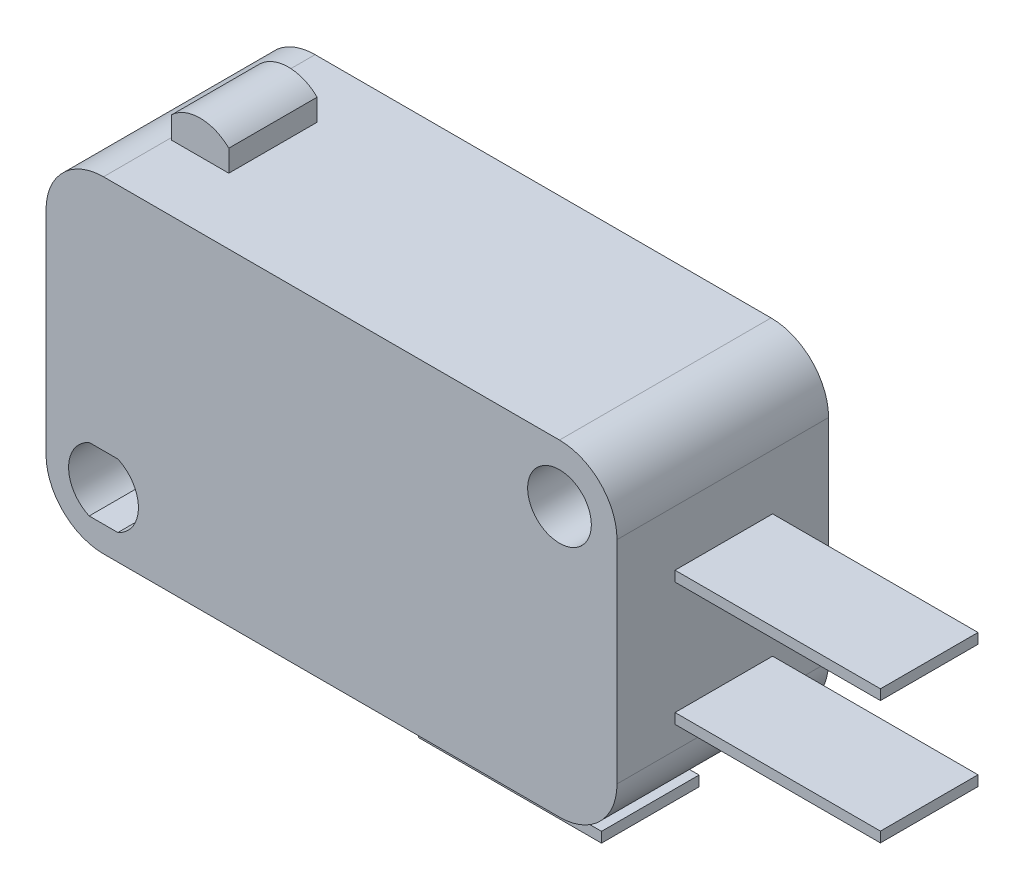
ISO-10303-21;
HEADER;
FILE_DESCRIPTION(('STEP AP214'),'2;1');
FILE_NAME('part.step','',(''),(''),'','','');
FILE_SCHEMA(('AUTOMOTIVE_DESIGN { 1 0 10303 214 1 1 1 1 }'));
ENDSEC;
DATA;
#1=APPLICATION_CONTEXT('core data for automotive mechanical design processes');
#2=APPLICATION_PROTOCOL_DEFINITION('international standard','automotive_design',2000,#1);
#3=PRODUCT_CONTEXT('',#1,'mechanical');
#4=PRODUCT('Part','Part','',(#3));
#5=PRODUCT_RELATED_PRODUCT_CATEGORY('part','',(#4));
#6=PRODUCT_DEFINITION_FORMATION('','',#4);
#7=PRODUCT_DEFINITION_CONTEXT('part definition',#1,'design');
#8=PRODUCT_DEFINITION('design','',#6,#7);
#9=PRODUCT_DEFINITION_SHAPE('','',#8);
#10=(LENGTH_UNIT() NAMED_UNIT(*) SI_UNIT(.MILLI.,.METRE.));
#11=(NAMED_UNIT(*) PLANE_ANGLE_UNIT() SI_UNIT($,.RADIAN.));
#12=(NAMED_UNIT(*) SI_UNIT($,.STERADIAN.) SOLID_ANGLE_UNIT());
#13=UNCERTAINTY_MEASURE_WITH_UNIT(LENGTH_MEASURE(1.E-05),#10,'distance_accuracy_value','');
#14=(GEOMETRIC_REPRESENTATION_CONTEXT(3) GLOBAL_UNCERTAINTY_ASSIGNED_CONTEXT((#13)) GLOBAL_UNIT_ASSIGNED_CONTEXT((#10,
#11,#12)) REPRESENTATION_CONTEXT('',''));
#15=CARTESIAN_POINT('',(0.,0.,0.));
#16=DIRECTION('',(0.,0.,1.));
#17=DIRECTION('',(1.,0.,0.));
#18=AXIS2_PLACEMENT_3D('',#15,#16,#17);
#19=CARTESIAN_POINT('',(-25.,-13.1,5.15));
#20=DIRECTION('',(0.,1.,0.));
#21=DIRECTION('',(-1.,0.,0.));
#22=AXIS2_PLACEMENT_3D('',#19,#20,#21);
#23=PLANE('',#22);
#24=DIRECTION('',(1.,0.,0.));
#25=VECTOR('',#24,1.);
#26=CARTESIAN_POINT('',(-25.,-13.1,5.15));
#27=LINE('',#26,#25);
#28=CARTESIAN_POINT('',(-22.2,-13.1,5.15));
#29=VERTEX_POINT('',#28);
#30=CARTESIAN_POINT('',(0.,-13.1,5.15));
#31=VERTEX_POINT('',#30);
#32=EDGE_CURVE('E410',#29,#31,#27,.T.);
#33=ORIENTED_EDGE('',*,*,#32,.F.);
#34=DIRECTION('',(0.,0.,-1.));
#35=VECTOR('',#34,1.);
#36=CARTESIAN_POINT('',(-22.2,-13.1,5.15));
#37=LINE('',#36,#35);
#38=CARTESIAN_POINT('',(-22.2,-13.1,-5.15));
#39=VERTEX_POINT('',#38);
#40=EDGE_CURVE('E447',#29,#39,#37,.T.);
#41=ORIENTED_EDGE('',*,*,#40,.T.);
#42=DIRECTION('',(1.,0.,0.));
#43=VECTOR('',#42,1.);
#44=CARTESIAN_POINT('',(-25.,-13.1,-5.15));
#45=LINE('',#44,#43);
#46=CARTESIAN_POINT('',(0.,-13.1,-5.15));
#47=VERTEX_POINT('',#46);
#48=EDGE_CURVE('E398',#39,#47,#45,.T.);
#49=ORIENTED_EDGE('',*,*,#48,.T.);
#50=DIRECTION('',(0.,0.,-1.));
#51=VECTOR('',#50,1.);
#52=CARTESIAN_POINT('',(0.,-13.1,5.15));
#53=LINE('',#52,#51);
#54=EDGE_CURVE('E445',#47,#31,#53,.F.);
#55=ORIENTED_EDGE('',*,*,#54,.T.);
#56=EDGE_LOOP('',(#33,#41,#49,#55));
#57=FACE_BOUND('',#56,.T.);
#58=DIRECTION('',(-1.,0.,0.));
#59=VECTOR('',#58,1.);
#60=CARTESIAN_POINT('',(-9.68,-13.1,2.325));
#61=LINE('',#60,#59);
#62=CARTESIAN_POINT('',(-9.18,-13.1,2.325));
#63=VERTEX_POINT('',#62);
#64=CARTESIAN_POINT('',(-9.68,-13.1,2.325));
#65=VERTEX_POINT('',#64);
#66=EDGE_CURVE('E299',#63,#65,#61,.T.);
#67=ORIENTED_EDGE('',*,*,#66,.F.);
#68=DIRECTION('',(0.,0.,-1.));
#69=VECTOR('',#68,1.);
#70=CARTESIAN_POINT('',(-9.18,-13.1,2.325));
#71=LINE('',#70,#69);
#72=CARTESIAN_POINT('',(-9.18,-13.1,-2.425));
#73=VERTEX_POINT('',#72);
#74=EDGE_CURVE('E312',#63,#73,#71,.T.);
#75=ORIENTED_EDGE('',*,*,#74,.T.);
#76=DIRECTION('',(-1.,0.,0.));
#77=VECTOR('',#76,1.);
#78=CARTESIAN_POINT('',(-9.68,-13.1,-2.425));
#79=LINE('',#78,#77);
#80=CARTESIAN_POINT('',(-9.68,-13.1,-2.425));
#81=VERTEX_POINT('',#80);
#82=EDGE_CURVE('E286',#73,#81,#79,.T.);
#83=ORIENTED_EDGE('',*,*,#82,.T.);
#84=DIRECTION('',(0.,0.,-1.));
#85=VECTOR('',#84,1.);
#86=CARTESIAN_POINT('',(-9.68,-13.1,2.325));
#87=LINE('',#86,#85);
#88=EDGE_CURVE('E327',#65,#81,#87,.T.);
#89=ORIENTED_EDGE('',*,*,#88,.F.);
#90=EDGE_LOOP('',(#67,#75,#83,#89));
#91=FACE_BOUND('',#90,.T.);
#92=ADVANCED_FACE('F16',(#57,#91),#23,.F.);
#93=CARTESIAN_POINT('',(2.8,2.8,5.15));
#94=DIRECTION('',(-1.,0.,0.));
#95=DIRECTION('',(0.,-1.,0.));
#96=AXIS2_PLACEMENT_3D('',#93,#94,#95);
#97=PLANE('',#96);
#98=DIRECTION('',(0.,-1.,0.));
#99=VECTOR('',#98,1.);
#100=CARTESIAN_POINT('',(2.8,-2.7,2.325));
#101=LINE('',#100,#99);
#102=CARTESIAN_POINT('',(2.8,-2.7,2.325));
#103=VERTEX_POINT('',#102);
#104=CARTESIAN_POINT('',(2.8,-3.2,2.325));
#105=VERTEX_POINT('',#104);
#106=EDGE_CURVE('E362',#103,#105,#101,.T.);
#107=ORIENTED_EDGE('',*,*,#106,.F.);
#108=DIRECTION('',(0.,0.,1.));
#109=VECTOR('',#108,1.);
#110=CARTESIAN_POINT('',(2.8,-2.7,2.325));
#111=LINE('',#110,#109);
#112=CARTESIAN_POINT('',(2.8,-2.7,-2.425));
#113=VERTEX_POINT('',#112);
#114=EDGE_CURVE('E371',#113,#103,#111,.T.);
#115=ORIENTED_EDGE('',*,*,#114,.F.);
#116=DIRECTION('',(0.,1.,0.));
#117=VECTOR('',#116,1.);
#118=CARTESIAN_POINT('',(2.8,-2.7,-2.425));
#119=LINE('',#118,#117);
#120=CARTESIAN_POINT('',(2.8,-3.2,-2.425));
#121=VERTEX_POINT('',#120);
#122=EDGE_CURVE('E368',#121,#113,#119,.T.);
#123=ORIENTED_EDGE('',*,*,#122,.F.);
#124=DIRECTION('',(0.,0.,-1.));
#125=VECTOR('',#124,1.);
#126=CARTESIAN_POINT('',(2.8,-3.2,2.325));
#127=LINE('',#126,#125);
#128=EDGE_CURVE('E365',#105,#121,#127,.T.);
#129=ORIENTED_EDGE('',*,*,#128,.F.);
#130=EDGE_LOOP('',(#107,#115,#123,#129));
#131=FACE_BOUND('',#130,.T.);
#132=DIRECTION('',(0.,1.,0.));
#133=VECTOR('',#132,1.);
#134=CARTESIAN_POINT('',(2.8,2.8,5.15));
#135=LINE('',#134,#133);
#136=CARTESIAN_POINT('',(2.8,-10.3,5.15));
#137=VERTEX_POINT('',#136);
#138=CARTESIAN_POINT('',(2.8,0.,5.15));
#139=VERTEX_POINT('',#138);
#140=EDGE_CURVE('E413',#137,#139,#135,.T.);
#141=ORIENTED_EDGE('',*,*,#140,.F.);
#142=DIRECTION('',(0.,0.,-1.));
#143=VECTOR('',#142,1.);
#144=CARTESIAN_POINT('',(2.8,-10.3,5.15));
#145=LINE('',#144,#143);
#146=CARTESIAN_POINT('',(2.8,-10.3,-5.15));
#147=VERTEX_POINT('',#146);
#148=EDGE_CURVE('E11',#137,#147,#145,.T.);
#149=ORIENTED_EDGE('',*,*,#148,.T.);
#150=DIRECTION('',(0.,1.,0.));
#151=VECTOR('',#150,1.);
#152=CARTESIAN_POINT('',(2.8,2.8,-5.15));
#153=LINE('',#152,#151);
#154=CARTESIAN_POINT('',(2.8,0.,-5.15));
#155=VERTEX_POINT('',#154);
#156=EDGE_CURVE('E401',#147,#155,#153,.T.);
#157=ORIENTED_EDGE('',*,*,#156,.T.);
#158=DIRECTION('',(0.,0.,-1.));
#159=VECTOR('',#158,1.);
#160=CARTESIAN_POINT('',(2.8,0.,5.15));
#161=LINE('',#160,#159);
#162=EDGE_CURVE('E24',#155,#139,#161,.F.);
#163=ORIENTED_EDGE('',*,*,#162,.T.);
#164=EDGE_LOOP('',(#141,#149,#157,#163));
#165=FACE_BOUND('',#164,.T.);
#166=DIRECTION('',(0.,-1.,0.));
#167=VECTOR('',#166,1.);
#168=CARTESIAN_POINT('',(2.8,-8.7,2.325));
#169=LINE('',#168,#167);
#170=CARTESIAN_POINT('',(2.8,-8.7,2.325));
#171=VERTEX_POINT('',#170);
#172=CARTESIAN_POINT('',(2.8,-9.2,2.325));
#173=VERTEX_POINT('',#172);
#174=EDGE_CURVE('E329',#171,#173,#169,.T.);
#175=ORIENTED_EDGE('',*,*,#174,.F.);
#176=DIRECTION('',(0.,0.,1.));
#177=VECTOR('',#176,1.);
#178=CARTESIAN_POINT('',(2.8,-8.7,2.325));
#179=LINE('',#178,#177);
#180=CARTESIAN_POINT('',(2.8,-8.7,-2.425));
#181=VERTEX_POINT('',#180);
#182=EDGE_CURVE('E338',#181,#171,#179,.T.);
#183=ORIENTED_EDGE('',*,*,#182,.F.);
#184=DIRECTION('',(0.,1.,0.));
#185=VECTOR('',#184,1.);
#186=CARTESIAN_POINT('',(2.8,-8.7,-2.425));
#187=LINE('',#186,#185);
#188=CARTESIAN_POINT('',(2.8,-9.2,-2.425));
#189=VERTEX_POINT('',#188);
#190=EDGE_CURVE('E335',#189,#181,#187,.T.);
#191=ORIENTED_EDGE('',*,*,#190,.F.);
#192=DIRECTION('',(0.,0.,-1.));
#193=VECTOR('',#192,1.);
#194=CARTESIAN_POINT('',(2.8,-9.2,2.325));
#195=LINE('',#194,#193);
#196=EDGE_CURVE('E332',#173,#189,#195,.T.);
#197=ORIENTED_EDGE('',*,*,#196,.F.);
#198=EDGE_LOOP('',(#175,#183,#191,#197));
#199=FACE_BOUND('',#198,.T.);
#200=ADVANCED_FACE('F452',(#131,#165,#199),#97,.F.);
#201=CARTESIAN_POINT('',(-25.,2.8,5.15));
#202=DIRECTION('',(1.,0.,0.));
#203=DIRECTION('',(0.,1.,0.));
#204=AXIS2_PLACEMENT_3D('',#201,#202,#203);
#205=PLANE('',#204);
#206=DIRECTION('',(0.,-1.,0.));
#207=VECTOR('',#206,1.);
#208=CARTESIAN_POINT('',(-25.,2.8,5.15));
#209=LINE('',#208,#207);
#210=CARTESIAN_POINT('',(-25.,0.,5.15));
#211=VERTEX_POINT('',#210);
#212=CARTESIAN_POINT('',(-25.,-10.3,5.15));
#213=VERTEX_POINT('',#212);
#214=EDGE_CURVE('E407',#211,#213,#209,.T.);
#215=ORIENTED_EDGE('',*,*,#214,.F.);
#216=DIRECTION('',(0.,0.,-1.));
#217=VECTOR('',#216,1.);
#218=CARTESIAN_POINT('',(-25.,0.,5.15));
#219=LINE('',#218,#217);
#220=CARTESIAN_POINT('',(-25.,0.,-5.15));
#221=VERTEX_POINT('',#220);
#222=EDGE_CURVE('E421',#211,#221,#219,.T.);
#223=ORIENTED_EDGE('',*,*,#222,.T.);
#224=DIRECTION('',(0.,-1.,0.));
#225=VECTOR('',#224,1.);
#226=CARTESIAN_POINT('',(-25.,2.8,-5.15));
#227=LINE('',#226,#225);
#228=CARTESIAN_POINT('',(-25.,-10.3,-5.15));
#229=VERTEX_POINT('',#228);
#230=EDGE_CURVE('E395',#221,#229,#227,.T.);
#231=ORIENTED_EDGE('',*,*,#230,.T.);
#232=DIRECTION('',(0.,0.,-1.));
#233=VECTOR('',#232,1.);
#234=CARTESIAN_POINT('',(-25.,-10.3,5.15));
#235=LINE('',#234,#233);
#236=EDGE_CURVE('E419',#229,#213,#235,.F.);
#237=ORIENTED_EDGE('',*,*,#236,.T.);
#238=EDGE_LOOP('',(#215,#223,#231,#237));
#239=FACE_BOUND('',#238,.T.);
#240=ADVANCED_FACE('F18',(#239),#205,.F.);
#241=CARTESIAN_POINT('',(-25.,2.8,5.15));
#242=DIRECTION('',(0.,-1.,0.));
#243=DIRECTION('',(0.,0.,-1.));
#244=AXIS2_PLACEMENT_3D('',#241,#242,#243);
#245=PLANE('',#244);
#246=DIRECTION('',(0.,0.,-1.));
#247=VECTOR('',#246,1.);
#248=CARTESIAN_POINT('',(-19.3,2.8,1.95));
#249=LINE('',#248,#247);
#250=CARTESIAN_POINT('',(-19.3,2.8,1.95));
#251=VERTEX_POINT('',#250);
#252=CARTESIAN_POINT('',(-19.3,2.8,-2.35));
#253=VERTEX_POINT('',#252);
#254=EDGE_CURVE('E31',#251,#253,#249,.T.);
#255=ORIENTED_EDGE('',*,*,#254,.F.);
#256=DIRECTION('',(1.,0.,0.));
#257=VECTOR('',#256,1.);
#258=CARTESIAN_POINT('',(-22.1,2.8,1.95));
#259=LINE('',#258,#257);
#260=CARTESIAN_POINT('',(-22.1,2.8,1.95));
#261=VERTEX_POINT('',#260);
#262=EDGE_CURVE('E35',#261,#251,#259,.T.);
#263=ORIENTED_EDGE('',*,*,#262,.F.);
#264=DIRECTION('',(0.,0.,-1.));
#265=VECTOR('',#264,1.);
#266=CARTESIAN_POINT('',(-22.1,2.8,1.95));
#267=LINE('',#266,#265);
#268=CARTESIAN_POINT('',(-22.1,2.8,-2.35));
#269=VERTEX_POINT('',#268);
#270=EDGE_CURVE('E246',#261,#269,#267,.T.);
#271=ORIENTED_EDGE('',*,*,#270,.T.);
#272=DIRECTION('',(1.,0.,0.));
#273=VECTOR('',#272,1.);
#274=CARTESIAN_POINT('',(-22.1,2.8,-2.35));
#275=LINE('',#274,#273);
#276=EDGE_CURVE('E237',#269,#253,#275,.T.);
#277=ORIENTED_EDGE('',*,*,#276,.T.);
#278=EDGE_LOOP('',(#255,#263,#271,#277));
#279=FACE_BOUND('',#278,.T.);
#280=DIRECTION('',(-1.,0.,0.));
#281=VECTOR('',#280,1.);
#282=CARTESIAN_POINT('',(-25.,2.8,-5.15));
#283=LINE('',#282,#281);
#284=CARTESIAN_POINT('',(0.,2.8,-5.15));
#285=VERTEX_POINT('',#284);
#286=CARTESIAN_POINT('',(-22.2,2.8,-5.15));
#287=VERTEX_POINT('',#286);
#288=EDGE_CURVE('E404',#285,#287,#283,.T.);
#289=ORIENTED_EDGE('',*,*,#288,.T.);
#290=DIRECTION('',(0.,0.,-1.));
#291=VECTOR('',#290,1.);
#292=CARTESIAN_POINT('',(-22.2,2.8,5.15));
#293=LINE('',#292,#291);
#294=CARTESIAN_POINT('',(-22.2,2.8,5.15));
#295=VERTEX_POINT('',#294);
#296=EDGE_CURVE('E435',#287,#295,#293,.F.);
#297=ORIENTED_EDGE('',*,*,#296,.T.);
#298=DIRECTION('',(-1.,0.,0.));
#299=VECTOR('',#298,1.);
#300=CARTESIAN_POINT('',(-25.,2.8,5.15));
#301=LINE('',#300,#299);
#302=CARTESIAN_POINT('',(0.,2.8,5.15));
#303=VERTEX_POINT('',#302);
#304=EDGE_CURVE('E416',#303,#295,#301,.T.);
#305=ORIENTED_EDGE('',*,*,#304,.F.);
#306=DIRECTION('',(0.,0.,-1.));
#307=VECTOR('',#306,1.);
#308=CARTESIAN_POINT('',(0.,2.8,5.15));
#309=LINE('',#308,#307);
#310=EDGE_CURVE('E432',#303,#285,#309,.T.);
#311=ORIENTED_EDGE('',*,*,#310,.T.);
#312=EDGE_LOOP('',(#289,#297,#305,#311));
#313=FACE_BOUND('',#312,.T.);
#314=ADVANCED_FACE('F466',(#279,#313),#245,.F.);
#315=CARTESIAN_POINT('',(-25.,2.8,5.15));
#316=DIRECTION('',(0.,0.,1.));
#317=DIRECTION('',(1.,0.,0.));
#318=AXIS2_PLACEMENT_3D('',#315,#316,#317);
#319=PLANE('',#318);
#320=CARTESIAN_POINT('',(-22.2,-10.3,5.15));
#321=DIRECTION('',(0.,0.,1.));
#322=DIRECTION('',(1.,0.,0.));
#323=AXIS2_PLACEMENT_3D('',#320,#321,#322);
#324=CIRCLE('',#323,1.7);
#325=CARTESIAN_POINT('',(-22.8982120021885,-8.75,5.15));
#326=VERTEX_POINT('',#325);
#327=CARTESIAN_POINT('',(-22.8982120021885,-11.85,5.15));
#328=VERTEX_POINT('',#327);
#329=EDGE_CURVE('E221',#326,#328,#324,.T.);
#330=ORIENTED_EDGE('',*,*,#329,.F.);
#331=DIRECTION('',(-1.,0.,0.));
#332=VECTOR('',#331,1.);
#333=CARTESIAN_POINT('',(-22.8982120021885,-8.75,5.15));
#334=LINE('',#333,#332);
#335=CARTESIAN_POINT('',(-21.5017879978116,-8.75,5.15));
#336=VERTEX_POINT('',#335);
#337=EDGE_CURVE('E256',#336,#326,#334,.T.);
#338=ORIENTED_EDGE('',*,*,#337,.F.);
#339=CARTESIAN_POINT('',(-22.2,-10.3,5.15));
#340=DIRECTION('',(0.,0.,1.));
#341=DIRECTION('',(1.,0.,0.));
#342=AXIS2_PLACEMENT_3D('',#339,#340,#341);
#343=CIRCLE('',#342,1.7);
#344=CARTESIAN_POINT('',(-21.5017879978116,-11.85,5.15));
#345=VERTEX_POINT('',#344);
#346=EDGE_CURVE('E253',#345,#336,#343,.T.);
#347=ORIENTED_EDGE('',*,*,#346,.F.);
#348=DIRECTION('',(1.,0.,0.));
#349=VECTOR('',#348,1.);
#350=CARTESIAN_POINT('',(-22.8982120021885,-11.85,5.15));
#351=LINE('',#350,#349);
#352=EDGE_CURVE('E250',#328,#345,#351,.T.);
#353=ORIENTED_EDGE('',*,*,#352,.F.);
#354=EDGE_LOOP('',(#330,#338,#347,#353));
#355=FACE_BOUND('',#354,.T.);
#356=CARTESIAN_POINT('',(0.,0.,5.15));
#357=DIRECTION('',(0.,0.,1.));
#358=DIRECTION('',(1.,0.,0.));
#359=AXIS2_PLACEMENT_3D('',#356,#357,#358);
#360=CIRCLE('',#359,1.55);
#361=CARTESIAN_POINT('',(1.55,0.,5.15));
#362=VERTEX_POINT('',#361);
#363=EDGE_CURVE('E274',#362,#362,#360,.T.);
#364=ORIENTED_EDGE('',*,*,#363,.F.);
#365=EDGE_LOOP('',(#364));
#366=FACE_BOUND('',#365,.T.);
#367=ORIENTED_EDGE('',*,*,#304,.T.);
#368=CARTESIAN_POINT('',(-22.2,0.,5.15));
#369=DIRECTION('',(0.,0.,1.));
#370=DIRECTION('',(1.,0.,0.));
#371=AXIS2_PLACEMENT_3D('',#368,#369,#370);
#372=CIRCLE('',#371,2.8);
#373=EDGE_CURVE('E443',#295,#211,#372,.T.);
#374=ORIENTED_EDGE('',*,*,#373,.T.);
#375=ORIENTED_EDGE('',*,*,#214,.T.);
#376=CARTESIAN_POINT('',(-22.2,-10.3,5.15));
#377=DIRECTION('',(0.,0.,1.));
#378=DIRECTION('',(1.,0.,0.));
#379=AXIS2_PLACEMENT_3D('',#376,#377,#378);
#380=CIRCLE('',#379,2.8);
#381=EDGE_CURVE('E441',#213,#29,#380,.T.);
#382=ORIENTED_EDGE('',*,*,#381,.T.);
#383=ORIENTED_EDGE('',*,*,#32,.T.);
#384=CARTESIAN_POINT('',(0.,-10.3,5.15));
#385=DIRECTION('',(0.,0.,1.));
#386=DIRECTION('',(1.,0.,0.));
#387=AXIS2_PLACEMENT_3D('',#384,#385,#386);
#388=CIRCLE('',#387,2.8);
#389=EDGE_CURVE('E439',#31,#137,#388,.T.);
#390=ORIENTED_EDGE('',*,*,#389,.T.);
#391=ORIENTED_EDGE('',*,*,#140,.T.);
#392=CARTESIAN_POINT('',(0.,0.,5.15));
#393=DIRECTION('',(0.,0.,1.));
#394=DIRECTION('',(1.,0.,0.));
#395=AXIS2_PLACEMENT_3D('',#392,#393,#394);
#396=CIRCLE('',#395,2.8);
#397=EDGE_CURVE('E437',#139,#303,#396,.T.);
#398=ORIENTED_EDGE('',*,*,#397,.T.);
#399=EDGE_LOOP('',(#367,#374,#375,#382,#383,#390,#391,#398));
#400=FACE_BOUND('',#399,.T.);
#401=ADVANCED_FACE('F459',(#355,#366,#400),#319,.T.);
#402=CARTESIAN_POINT('',(-25.,2.8,-5.15));
#403=DIRECTION('',(0.,0.,1.));
#404=DIRECTION('',(1.,0.,0.));
#405=AXIS2_PLACEMENT_3D('',#402,#403,#404);
#406=PLANE('',#405);
#407=DIRECTION('',(-1.,0.,0.));
#408=VECTOR('',#407,1.);
#409=CARTESIAN_POINT('',(-22.8982120021885,-8.75,-5.15));
#410=LINE('',#409,#408);
#411=CARTESIAN_POINT('',(-21.5017879978116,-8.75,-5.15));
#412=VERTEX_POINT('',#411);
#413=CARTESIAN_POINT('',(-22.8982120021885,-8.75,-5.15));
#414=VERTEX_POINT('',#413);
#415=EDGE_CURVE('E268',#412,#414,#410,.T.);
#416=ORIENTED_EDGE('',*,*,#415,.T.);
#417=CARTESIAN_POINT('',(-22.2,-10.3,-5.15));
#418=DIRECTION('',(0.,0.,1.));
#419=DIRECTION('',(1.,0.,0.));
#420=AXIS2_PLACEMENT_3D('',#417,#418,#419);
#421=CIRCLE('',#420,1.7);
#422=CARTESIAN_POINT('',(-22.8982120021885,-11.85,-5.15));
#423=VERTEX_POINT('',#422);
#424=EDGE_CURVE('E259',#414,#423,#421,.T.);
#425=ORIENTED_EDGE('',*,*,#424,.T.);
#426=DIRECTION('',(1.,0.,0.));
#427=VECTOR('',#426,1.);
#428=CARTESIAN_POINT('',(-22.8982120021885,-11.85,-5.15));
#429=LINE('',#428,#427);
#430=CARTESIAN_POINT('',(-21.5017879978116,-11.85,-5.15));
#431=VERTEX_POINT('',#430);
#432=EDGE_CURVE('E262',#423,#431,#429,.T.);
#433=ORIENTED_EDGE('',*,*,#432,.T.);
#434=CARTESIAN_POINT('',(-22.2,-10.3,-5.15));
#435=DIRECTION('',(0.,0.,1.));
#436=DIRECTION('',(1.,0.,0.));
#437=AXIS2_PLACEMENT_3D('',#434,#435,#436);
#438=CIRCLE('',#437,1.7);
#439=EDGE_CURVE('E265',#431,#412,#438,.T.);
#440=ORIENTED_EDGE('',*,*,#439,.T.);
#441=EDGE_LOOP('',(#416,#425,#433,#440));
#442=FACE_BOUND('',#441,.T.);
#443=CARTESIAN_POINT('',(0.,0.,-5.15));
#444=DIRECTION('',(0.,0.,1.));
#445=DIRECTION('',(1.,0.,0.));
#446=AXIS2_PLACEMENT_3D('',#443,#444,#445);
#447=CIRCLE('',#446,1.55);
#448=CARTESIAN_POINT('',(1.55,0.,-5.15));
#449=VERTEX_POINT('',#448);
#450=EDGE_CURVE('E283',#449,#449,#447,.T.);
#451=ORIENTED_EDGE('',*,*,#450,.T.);
#452=EDGE_LOOP('',(#451));
#453=FACE_BOUND('',#452,.T.);
#454=ORIENTED_EDGE('',*,*,#230,.F.);
#455=CARTESIAN_POINT('',(-22.2,0.,-5.15));
#456=DIRECTION('',(0.,0.,1.));
#457=DIRECTION('',(1.,0.,0.));
#458=AXIS2_PLACEMENT_3D('',#455,#456,#457);
#459=CIRCLE('',#458,2.8);
#460=EDGE_CURVE('E430',#221,#287,#459,.F.);
#461=ORIENTED_EDGE('',*,*,#460,.T.);
#462=ORIENTED_EDGE('',*,*,#288,.F.);
#463=CARTESIAN_POINT('',(0.,0.,-5.15));
#464=DIRECTION('',(0.,0.,1.));
#465=DIRECTION('',(1.,0.,0.));
#466=AXIS2_PLACEMENT_3D('',#463,#464,#465);
#467=CIRCLE('',#466,2.8);
#468=EDGE_CURVE('E424',#285,#155,#467,.F.);
#469=ORIENTED_EDGE('',*,*,#468,.T.);
#470=ORIENTED_EDGE('',*,*,#156,.F.);
#471=CARTESIAN_POINT('',(0.,-10.3,-5.15));
#472=DIRECTION('',(0.,0.,1.));
#473=DIRECTION('',(1.,0.,0.));
#474=AXIS2_PLACEMENT_3D('',#471,#472,#473);
#475=CIRCLE('',#474,2.8);
#476=EDGE_CURVE('E426',#147,#47,#475,.F.);
#477=ORIENTED_EDGE('',*,*,#476,.T.);
#478=ORIENTED_EDGE('',*,*,#48,.F.);
#479=CARTESIAN_POINT('',(-22.2,-10.3,-5.15));
#480=DIRECTION('',(0.,0.,1.));
#481=DIRECTION('',(1.,0.,0.));
#482=AXIS2_PLACEMENT_3D('',#479,#480,#481);
#483=CIRCLE('',#482,2.8);
#484=EDGE_CURVE('E428',#39,#229,#483,.F.);
#485=ORIENTED_EDGE('',*,*,#484,.T.);
#486=EDGE_LOOP('',(#454,#461,#462,#469,#470,#477,#478,#485));
#487=FACE_BOUND('',#486,.T.);
#488=ADVANCED_FACE('F470',(#442,#453,#487),#406,.F.);
#489=CARTESIAN_POINT('',(12.8,-2.7,2.325));
#490=DIRECTION('',(0.,0.,-1.));
#491=DIRECTION('',(0.,1.,0.));
#492=AXIS2_PLACEMENT_3D('',#489,#490,#491);
#493=PLANE('',#492);
#494=ORIENTED_EDGE('',*,*,#106,.T.);
#495=DIRECTION('',(-1.,0.,0.));
#496=VECTOR('',#495,1.);
#497=CARTESIAN_POINT('',(12.8,-3.2,2.325));
#498=LINE('',#497,#496);
#499=CARTESIAN_POINT('',(12.8,-3.2,2.325));
#500=VERTEX_POINT('',#499);
#501=EDGE_CURVE('E392',#500,#105,#498,.T.);
#502=ORIENTED_EDGE('',*,*,#501,.F.);
#503=DIRECTION('',(0.,-1.,0.));
#504=VECTOR('',#503,1.);
#505=CARTESIAN_POINT('',(12.8,-2.7,2.325));
#506=LINE('',#505,#504);
#507=CARTESIAN_POINT('',(12.8,-2.7,2.325));
#508=VERTEX_POINT('',#507);
#509=EDGE_CURVE('E374',#508,#500,#506,.T.);
#510=ORIENTED_EDGE('',*,*,#509,.F.);
#511=DIRECTION('',(-1.,0.,0.));
#512=VECTOR('',#511,1.);
#513=CARTESIAN_POINT('',(12.8,-2.7,2.325));
#514=LINE('',#513,#512);
#515=EDGE_CURVE('E383',#508,#103,#514,.T.);
#516=ORIENTED_EDGE('',*,*,#515,.T.);
#517=EDGE_LOOP('',(#494,#502,#510,#516));
#518=FACE_BOUND('',#517,.T.);
#519=ADVANCED_FACE('F512',(#518),#493,.F.);
#520=CARTESIAN_POINT('',(12.8,-3.2,2.325));
#521=DIRECTION('',(0.,1.,0.));
#522=DIRECTION('',(-1.,0.,0.));
#523=AXIS2_PLACEMENT_3D('',#520,#521,#522);
#524=PLANE('',#523);
#525=ORIENTED_EDGE('',*,*,#128,.T.);
#526=DIRECTION('',(-1.,0.,0.));
#527=VECTOR('',#526,1.);
#528=CARTESIAN_POINT('',(12.8,-3.2,-2.425));
#529=LINE('',#528,#527);
#530=CARTESIAN_POINT('',(12.8,-3.2,-2.425));
#531=VERTEX_POINT('',#530);
#532=EDGE_CURVE('E389',#531,#121,#529,.T.);
#533=ORIENTED_EDGE('',*,*,#532,.F.);
#534=DIRECTION('',(0.,0.,-1.));
#535=VECTOR('',#534,1.);
#536=CARTESIAN_POINT('',(12.8,-3.2,2.325));
#537=LINE('',#536,#535);
#538=EDGE_CURVE('E377',#500,#531,#537,.T.);
#539=ORIENTED_EDGE('',*,*,#538,.F.);
#540=ORIENTED_EDGE('',*,*,#501,.T.);
#541=EDGE_LOOP('',(#525,#533,#539,#540));
#542=FACE_BOUND('',#541,.T.);
#543=ADVANCED_FACE('F516',(#542),#524,.F.);
#544=CARTESIAN_POINT('',(12.8,-2.7,-2.425));
#545=DIRECTION('',(0.,0.,1.));
#546=DIRECTION('',(0.,-1.,0.));
#547=AXIS2_PLACEMENT_3D('',#544,#545,#546);
#548=PLANE('',#547);
#549=ORIENTED_EDGE('',*,*,#122,.T.);
#550=DIRECTION('',(-1.,0.,0.));
#551=VECTOR('',#550,1.);
#552=CARTESIAN_POINT('',(12.8,-2.7,-2.425));
#553=LINE('',#552,#551);
#554=CARTESIAN_POINT('',(12.8,-2.7,-2.425));
#555=VERTEX_POINT('',#554);
#556=EDGE_CURVE('E386',#555,#113,#553,.T.);
#557=ORIENTED_EDGE('',*,*,#556,.F.);
#558=DIRECTION('',(0.,1.,0.));
#559=VECTOR('',#558,1.);
#560=CARTESIAN_POINT('',(12.8,-2.7,-2.425));
#561=LINE('',#560,#559);
#562=EDGE_CURVE('E379',#531,#555,#561,.T.);
#563=ORIENTED_EDGE('',*,*,#562,.F.);
#564=ORIENTED_EDGE('',*,*,#532,.T.);
#565=EDGE_LOOP('',(#549,#557,#563,#564));
#566=FACE_BOUND('',#565,.T.);
#567=ADVANCED_FACE('F520',(#566),#548,.F.);
#568=CARTESIAN_POINT('',(12.8,-2.7,2.325));
#569=DIRECTION('',(0.,-1.,0.));
#570=DIRECTION('',(1.,0.,0.));
#571=AXIS2_PLACEMENT_3D('',#568,#569,#570);
#572=PLANE('',#571);
#573=ORIENTED_EDGE('',*,*,#114,.T.);
#574=ORIENTED_EDGE('',*,*,#515,.F.);
#575=DIRECTION('',(0.,0.,1.));
#576=VECTOR('',#575,1.);
#577=CARTESIAN_POINT('',(12.8,-2.7,2.325));
#578=LINE('',#577,#576);
#579=EDGE_CURVE('E381',#555,#508,#578,.T.);
#580=ORIENTED_EDGE('',*,*,#579,.F.);
#581=ORIENTED_EDGE('',*,*,#556,.T.);
#582=EDGE_LOOP('',(#573,#574,#580,#581));
#583=FACE_BOUND('',#582,.T.);
#584=ADVANCED_FACE('F524',(#583),#572,.F.);
#585=CARTESIAN_POINT('',(12.8,-3.2,2.325));
#586=DIRECTION('',(1.,0.,0.));
#587=DIRECTION('',(0.,0.,-1.));
#588=AXIS2_PLACEMENT_3D('',#585,#586,#587);
#589=PLANE('',#588);
#590=ORIENTED_EDGE('',*,*,#509,.T.);
#591=ORIENTED_EDGE('',*,*,#538,.T.);
#592=ORIENTED_EDGE('',*,*,#562,.T.);
#593=ORIENTED_EDGE('',*,*,#579,.T.);
#594=EDGE_LOOP('',(#590,#591,#592,#593));
#595=FACE_BOUND('',#594,.T.);
#596=ADVANCED_FACE('F528',(#595),#589,.T.);
#597=CARTESIAN_POINT('',(12.8,-8.7,2.325));
#598=DIRECTION('',(0.,0.,-1.));
#599=DIRECTION('',(0.,1.,0.));
#600=AXIS2_PLACEMENT_3D('',#597,#598,#599);
#601=PLANE('',#600);
#602=ORIENTED_EDGE('',*,*,#174,.T.);
#603=DIRECTION('',(-1.,0.,0.));
#604=VECTOR('',#603,1.);
#605=CARTESIAN_POINT('',(12.8,-9.2,2.325));
#606=LINE('',#605,#604);
#607=CARTESIAN_POINT('',(12.8,-9.2,2.325));
#608=VERTEX_POINT('',#607);
#609=EDGE_CURVE('E359',#608,#173,#606,.T.);
#610=ORIENTED_EDGE('',*,*,#609,.F.);
#611=DIRECTION('',(0.,-1.,0.));
#612=VECTOR('',#611,1.);
#613=CARTESIAN_POINT('',(12.8,-8.7,2.325));
#614=LINE('',#613,#612);
#615=CARTESIAN_POINT('',(12.8,-8.7,2.325));
#616=VERTEX_POINT('',#615);
#617=EDGE_CURVE('E341',#616,#608,#614,.T.);
#618=ORIENTED_EDGE('',*,*,#617,.F.);
#619=DIRECTION('',(-1.,0.,0.));
#620=VECTOR('',#619,1.);
#621=CARTESIAN_POINT('',(12.8,-8.7,2.325));
#622=LINE('',#621,#620);
#623=EDGE_CURVE('E350',#616,#171,#622,.T.);
#624=ORIENTED_EDGE('',*,*,#623,.T.);
#625=EDGE_LOOP('',(#602,#610,#618,#624));
#626=FACE_BOUND('',#625,.T.);
#627=ADVANCED_FACE('F532',(#626),#601,.F.);
#628=CARTESIAN_POINT('',(12.8,-9.2,2.325));
#629=DIRECTION('',(0.,1.,0.));
#630=DIRECTION('',(-1.,0.,0.));
#631=AXIS2_PLACEMENT_3D('',#628,#629,#630);
#632=PLANE('',#631);
#633=ORIENTED_EDGE('',*,*,#196,.T.);
#634=DIRECTION('',(-1.,0.,0.));
#635=VECTOR('',#634,1.);
#636=CARTESIAN_POINT('',(12.8,-9.2,-2.425));
#637=LINE('',#636,#635);
#638=CARTESIAN_POINT('',(12.8,-9.2,-2.425));
#639=VERTEX_POINT('',#638);
#640=EDGE_CURVE('E356',#639,#189,#637,.T.);
#641=ORIENTED_EDGE('',*,*,#640,.F.);
#642=DIRECTION('',(0.,0.,-1.));
#643=VECTOR('',#642,1.);
#644=CARTESIAN_POINT('',(12.8,-9.2,2.325));
#645=LINE('',#644,#643);
#646=EDGE_CURVE('E344',#608,#639,#645,.T.);
#647=ORIENTED_EDGE('',*,*,#646,.F.);
#648=ORIENTED_EDGE('',*,*,#609,.T.);
#649=EDGE_LOOP('',(#633,#641,#647,#648));
#650=FACE_BOUND('',#649,.T.);
#651=ADVANCED_FACE('F536',(#650),#632,.F.);
#652=CARTESIAN_POINT('',(12.8,-8.7,-2.425));
#653=DIRECTION('',(0.,0.,1.));
#654=DIRECTION('',(1.,0.,0.));
#655=AXIS2_PLACEMENT_3D('',#652,#653,#654);
#656=PLANE('',#655);
#657=ORIENTED_EDGE('',*,*,#190,.T.);
#658=DIRECTION('',(-1.,0.,0.));
#659=VECTOR('',#658,1.);
#660=CARTESIAN_POINT('',(12.8,-8.7,-2.425));
#661=LINE('',#660,#659);
#662=CARTESIAN_POINT('',(12.8,-8.7,-2.425));
#663=VERTEX_POINT('',#662);
#664=EDGE_CURVE('E353',#663,#181,#661,.T.);
#665=ORIENTED_EDGE('',*,*,#664,.F.);
#666=DIRECTION('',(0.,1.,0.));
#667=VECTOR('',#666,1.);
#668=CARTESIAN_POINT('',(12.8,-8.7,-2.425));
#669=LINE('',#668,#667);
#670=EDGE_CURVE('E346',#639,#663,#669,.T.);
#671=ORIENTED_EDGE('',*,*,#670,.F.);
#672=ORIENTED_EDGE('',*,*,#640,.T.);
#673=EDGE_LOOP('',(#657,#665,#671,#672));
#674=FACE_BOUND('',#673,.T.);
#675=ADVANCED_FACE('F540',(#674),#656,.F.);
#676=CARTESIAN_POINT('',(12.8,-8.7,2.325));
#677=DIRECTION('',(0.,-1.,0.));
#678=DIRECTION('',(1.,0.,0.));
#679=AXIS2_PLACEMENT_3D('',#676,#677,#678);
#680=PLANE('',#679);
#681=ORIENTED_EDGE('',*,*,#182,.T.);
#682=ORIENTED_EDGE('',*,*,#623,.F.);
#683=DIRECTION('',(0.,0.,1.));
#684=VECTOR('',#683,1.);
#685=CARTESIAN_POINT('',(12.8,-8.7,2.325));
#686=LINE('',#685,#684);
#687=EDGE_CURVE('E348',#663,#616,#686,.T.);
#688=ORIENTED_EDGE('',*,*,#687,.F.);
#689=ORIENTED_EDGE('',*,*,#664,.T.);
#690=EDGE_LOOP('',(#681,#682,#688,#689));
#691=FACE_BOUND('',#690,.T.);
#692=ADVANCED_FACE('F544',(#691),#680,.F.);
#693=CARTESIAN_POINT('',(12.8,-9.2,2.325));
#694=DIRECTION('',(1.,0.,0.));
#695=DIRECTION('',(0.,0.,-1.));
#696=AXIS2_PLACEMENT_3D('',#693,#694,#695);
#697=PLANE('',#696);
#698=ORIENTED_EDGE('',*,*,#617,.T.);
#699=ORIENTED_EDGE('',*,*,#646,.T.);
#700=ORIENTED_EDGE('',*,*,#670,.T.);
#701=ORIENTED_EDGE('',*,*,#687,.T.);
#702=EDGE_LOOP('',(#698,#699,#700,#701));
#703=FACE_BOUND('',#702,.T.);
#704=ADVANCED_FACE('F548',(#703),#697,.T.);
#705=CARTESIAN_POINT('',(-9.68,-16.,2.325));
#706=DIRECTION('',(1.,0.,0.));
#707=DIRECTION('',(0.,1.,0.));
#708=AXIS2_PLACEMENT_3D('',#705,#706,#707);
#709=PLANE('',#708);
#710=DIRECTION('',(0.,-1.,0.));
#711=VECTOR('',#710,1.);
#712=CARTESIAN_POINT('',(-9.68,-16.,-2.425));
#713=LINE('',#712,#711);
#714=CARTESIAN_POINT('',(-9.68,-16.,-2.425));
#715=VERTEX_POINT('',#714);
#716=EDGE_CURVE('E289',#81,#715,#713,.T.);
#717=ORIENTED_EDGE('',*,*,#716,.T.);
#718=DIRECTION('',(0.,0.,-1.));
#719=VECTOR('',#718,1.);
#720=CARTESIAN_POINT('',(-9.68,-16.,2.325));
#721=LINE('',#720,#719);
#722=CARTESIAN_POINT('',(-9.68,-16.,2.325));
#723=VERTEX_POINT('',#722);
#724=EDGE_CURVE('E324',#723,#715,#721,.T.);
#725=ORIENTED_EDGE('',*,*,#724,.F.);
#726=DIRECTION('',(0.,-1.,0.));
#727=VECTOR('',#726,1.);
#728=CARTESIAN_POINT('',(-9.68,-16.,2.325));
#729=LINE('',#728,#727);
#730=EDGE_CURVE('E302',#65,#723,#729,.T.);
#731=ORIENTED_EDGE('',*,*,#730,.F.);
#732=ORIENTED_EDGE('',*,*,#88,.T.);
#733=EDGE_LOOP('',(#717,#725,#731,#732));
#734=FACE_BOUND('',#733,.T.);
#735=ADVANCED_FACE('F552',(#734),#709,.F.);
#736=CARTESIAN_POINT('',(-0.78,-16.,2.325));
#737=DIRECTION('',(0.,1.,0.));
#738=DIRECTION('',(0.,0.,1.));
#739=AXIS2_PLACEMENT_3D('',#736,#737,#738);
#740=PLANE('',#739);
#741=DIRECTION('',(1.,0.,0.));
#742=VECTOR('',#741,1.);
#743=CARTESIAN_POINT('',(-0.78,-16.,-2.425));
#744=LINE('',#743,#742);
#745=CARTESIAN_POINT('',(-0.78,-16.,-2.425));
#746=VERTEX_POINT('',#745);
#747=EDGE_CURVE('E291',#715,#746,#744,.T.);
#748=ORIENTED_EDGE('',*,*,#747,.T.);
#749=DIRECTION('',(0.,0.,-1.));
#750=VECTOR('',#749,1.);
#751=CARTESIAN_POINT('',(-0.78,-16.,2.325));
#752=LINE('',#751,#750);
#753=CARTESIAN_POINT('',(-0.78,-16.,2.325));
#754=VERTEX_POINT('',#753);
#755=EDGE_CURVE('E321',#754,#746,#752,.T.);
#756=ORIENTED_EDGE('',*,*,#755,.F.);
#757=DIRECTION('',(1.,0.,0.));
#758=VECTOR('',#757,1.);
#759=CARTESIAN_POINT('',(-0.78,-16.,2.325));
#760=LINE('',#759,#758);
#761=EDGE_CURVE('E304',#723,#754,#760,.T.);
#762=ORIENTED_EDGE('',*,*,#761,.F.);
#763=ORIENTED_EDGE('',*,*,#724,.T.);
#764=EDGE_LOOP('',(#748,#756,#762,#763));
#765=FACE_BOUND('',#764,.T.);
#766=ADVANCED_FACE('F556',(#765),#740,.F.);
#767=CARTESIAN_POINT('',(-0.78,-15.5,2.325));
#768=DIRECTION('',(-1.,0.,0.));
#769=DIRECTION('',(0.,0.,1.));
#770=AXIS2_PLACEMENT_3D('',#767,#768,#769);
#771=PLANE('',#770);
#772=DIRECTION('',(0.,1.,0.));
#773=VECTOR('',#772,1.);
#774=CARTESIAN_POINT('',(-0.78,-15.5,-2.425));
#775=LINE('',#774,#773);
#776=CARTESIAN_POINT('',(-0.78,-15.5,-2.425));
#777=VERTEX_POINT('',#776);
#778=EDGE_CURVE('E293',#746,#777,#775,.T.);
#779=ORIENTED_EDGE('',*,*,#778,.T.);
#780=DIRECTION('',(0.,0.,-1.));
#781=VECTOR('',#780,1.);
#782=CARTESIAN_POINT('',(-0.78,-15.5,2.325));
#783=LINE('',#782,#781);
#784=CARTESIAN_POINT('',(-0.78,-15.5,2.325));
#785=VERTEX_POINT('',#784);
#786=EDGE_CURVE('E318',#785,#777,#783,.T.);
#787=ORIENTED_EDGE('',*,*,#786,.F.);
#788=DIRECTION('',(0.,1.,0.));
#789=VECTOR('',#788,1.);
#790=CARTESIAN_POINT('',(-0.78,-15.5,2.325));
#791=LINE('',#790,#789);
#792=EDGE_CURVE('E306',#754,#785,#791,.T.);
#793=ORIENTED_EDGE('',*,*,#792,.F.);
#794=ORIENTED_EDGE('',*,*,#755,.T.);
#795=EDGE_LOOP('',(#779,#787,#793,#794));
#796=FACE_BOUND('',#795,.T.);
#797=ADVANCED_FACE('F560',(#796),#771,.F.);
#798=CARTESIAN_POINT('',(-9.18,-15.5,2.325));
#799=DIRECTION('',(0.,-1.,0.));
#800=DIRECTION('',(0.,0.,-1.));
#801=AXIS2_PLACEMENT_3D('',#798,#799,#800);
#802=PLANE('',#801);
#803=DIRECTION('',(-1.,0.,0.));
#804=VECTOR('',#803,1.);
#805=CARTESIAN_POINT('',(-9.18,-15.5,-2.425));
#806=LINE('',#805,#804);
#807=CARTESIAN_POINT('',(-9.18,-15.5,-2.425));
#808=VERTEX_POINT('',#807);
#809=EDGE_CURVE('E295',#777,#808,#806,.T.);
#810=ORIENTED_EDGE('',*,*,#809,.T.);
#811=DIRECTION('',(0.,0.,-1.));
#812=VECTOR('',#811,1.);
#813=CARTESIAN_POINT('',(-9.18,-15.5,2.325));
#814=LINE('',#813,#812);
#815=CARTESIAN_POINT('',(-9.18,-15.5,2.325));
#816=VERTEX_POINT('',#815);
#817=EDGE_CURVE('E315',#816,#808,#814,.T.);
#818=ORIENTED_EDGE('',*,*,#817,.F.);
#819=DIRECTION('',(-1.,0.,0.));
#820=VECTOR('',#819,1.);
#821=CARTESIAN_POINT('',(-9.18,-15.5,2.325));
#822=LINE('',#821,#820);
#823=EDGE_CURVE('E308',#785,#816,#822,.T.);
#824=ORIENTED_EDGE('',*,*,#823,.F.);
#825=ORIENTED_EDGE('',*,*,#786,.T.);
#826=EDGE_LOOP('',(#810,#818,#824,#825));
#827=FACE_BOUND('',#826,.T.);
#828=ADVANCED_FACE('F564',(#827),#802,.F.);
#829=CARTESIAN_POINT('',(-9.18,-13.1,2.325));
#830=DIRECTION('',(-1.,0.,0.));
#831=DIRECTION('',(0.,0.,1.));
#832=AXIS2_PLACEMENT_3D('',#829,#830,#831);
#833=PLANE('',#832);
#834=DIRECTION('',(0.,1.,0.));
#835=VECTOR('',#834,1.);
#836=CARTESIAN_POINT('',(-9.18,-13.1,-2.425));
#837=LINE('',#836,#835);
#838=EDGE_CURVE('E297',#808,#73,#837,.T.);
#839=ORIENTED_EDGE('',*,*,#838,.T.);
#840=ORIENTED_EDGE('',*,*,#74,.F.);
#841=DIRECTION('',(0.,1.,0.));
#842=VECTOR('',#841,1.);
#843=CARTESIAN_POINT('',(-9.18,-13.1,2.325));
#844=LINE('',#843,#842);
#845=EDGE_CURVE('E310',#816,#63,#844,.T.);
#846=ORIENTED_EDGE('',*,*,#845,.F.);
#847=ORIENTED_EDGE('',*,*,#817,.T.);
#848=EDGE_LOOP('',(#839,#840,#846,#847));
#849=FACE_BOUND('',#848,.T.);
#850=ADVANCED_FACE('F568',(#849),#833,.F.);
#851=CARTESIAN_POINT('',(-9.18,-13.1,2.325));
#852=DIRECTION('',(0.,0.,-1.));
#853=DIRECTION('',(-1.,0.,0.));
#854=AXIS2_PLACEMENT_3D('',#851,#852,#853);
#855=PLANE('',#854);
#856=ORIENTED_EDGE('',*,*,#66,.T.);
#857=ORIENTED_EDGE('',*,*,#730,.T.);
#858=ORIENTED_EDGE('',*,*,#761,.T.);
#859=ORIENTED_EDGE('',*,*,#792,.T.);
#860=ORIENTED_EDGE('',*,*,#823,.T.);
#861=ORIENTED_EDGE('',*,*,#845,.T.);
#862=EDGE_LOOP('',(#856,#857,#858,#859,#860,#861));
#863=FACE_BOUND('',#862,.T.);
#864=ADVANCED_FACE('F572',(#863),#855,.F.);
#865=CARTESIAN_POINT('',(-9.18,-13.1,-2.425));
#866=DIRECTION('',(0.,0.,-1.));
#867=DIRECTION('',(-1.,0.,0.));
#868=AXIS2_PLACEMENT_3D('',#865,#866,#867);
#869=PLANE('',#868);
#870=ORIENTED_EDGE('',*,*,#82,.F.);
#871=ORIENTED_EDGE('',*,*,#838,.F.);
#872=ORIENTED_EDGE('',*,*,#809,.F.);
#873=ORIENTED_EDGE('',*,*,#778,.F.);
#874=ORIENTED_EDGE('',*,*,#747,.F.);
#875=ORIENTED_EDGE('',*,*,#716,.F.);
#876=EDGE_LOOP('',(#870,#871,#872,#873,#874,#875));
#877=FACE_BOUND('',#876,.T.);
#878=ADVANCED_FACE('F576',(#877),#869,.T.);
#879=CARTESIAN_POINT('',(0.,0.,-5.15));
#880=DIRECTION('',(0.,0.,1.));
#881=DIRECTION('',(1.,0.,0.));
#882=AXIS2_PLACEMENT_3D('',#879,#880,#881);
#883=CYLINDRICAL_SURFACE('',#882,1.55);
#884=ORIENTED_EDGE('',*,*,#450,.F.);
#885=EDGE_LOOP('',(#884));
#886=FACE_BOUND('',#885,.T.);
#887=ORIENTED_EDGE('',*,*,#363,.T.);
#888=EDGE_LOOP('',(#887));
#889=FACE_BOUND('',#888,.T.);
#890=ADVANCED_FACE('F580',(#886,#889),#883,.F.);
#891=CARTESIAN_POINT('',(-22.2,-10.3,-5.15));
#892=DIRECTION('',(0.,0.,1.));
#893=DIRECTION('',(1.,0.,0.));
#894=AXIS2_PLACEMENT_3D('',#891,#892,#893);
#895=CYLINDRICAL_SURFACE('',#894,1.7);
#896=ORIENTED_EDGE('',*,*,#329,.T.);
#897=DIRECTION('',(0.,0.,1.));
#898=VECTOR('',#897,1.);
#899=CARTESIAN_POINT('',(-22.8982120021885,-11.85,-5.15));
#900=LINE('',#899,#898);
#901=EDGE_CURVE('E271',#423,#328,#900,.T.);
#902=ORIENTED_EDGE('',*,*,#901,.F.);
#903=ORIENTED_EDGE('',*,*,#424,.F.);
#904=DIRECTION('',(0.,0.,1.));
#905=VECTOR('',#904,1.);
#906=CARTESIAN_POINT('',(-22.8982120021885,-8.75,-5.15));
#907=LINE('',#906,#905);
#908=EDGE_CURVE('E272',#414,#326,#907,.T.);
#909=ORIENTED_EDGE('',*,*,#908,.T.);
#910=EDGE_LOOP('',(#896,#902,#903,#909));
#911=FACE_BOUND('',#910,.T.);
#912=ADVANCED_FACE('F584',(#911),#895,.F.);
#913=CARTESIAN_POINT('',(-22.8982120021885,-8.75,-5.15));
#914=DIRECTION('',(0.,1.,0.));
#915=DIRECTION('',(0.,0.,1.));
#916=AXIS2_PLACEMENT_3D('',#913,#914,#915);
#917=PLANE('',#916);
#918=ORIENTED_EDGE('',*,*,#337,.T.);
#919=ORIENTED_EDGE('',*,*,#908,.F.);
#920=ORIENTED_EDGE('',*,*,#415,.F.);
#921=DIRECTION('',(0.,0.,1.));
#922=VECTOR('',#921,1.);
#923=CARTESIAN_POINT('',(-21.5017879978116,-8.75,-5.15));
#924=LINE('',#923,#922);
#925=EDGE_CURVE('E275',#412,#336,#924,.T.);
#926=ORIENTED_EDGE('',*,*,#925,.T.);
#927=EDGE_LOOP('',(#918,#919,#920,#926));
#928=FACE_BOUND('',#927,.T.);
#929=ADVANCED_FACE('F588',(#928),#917,.F.);
#930=CARTESIAN_POINT('',(-22.2,-10.3,-5.15));
#931=DIRECTION('',(0.,0.,1.));
#932=DIRECTION('',(1.,0.,0.));
#933=AXIS2_PLACEMENT_3D('',#930,#931,#932);
#934=CYLINDRICAL_SURFACE('',#933,1.7);
#935=ORIENTED_EDGE('',*,*,#346,.T.);
#936=ORIENTED_EDGE('',*,*,#925,.F.);
#937=ORIENTED_EDGE('',*,*,#439,.F.);
#938=DIRECTION('',(0.,0.,1.));
#939=VECTOR('',#938,1.);
#940=CARTESIAN_POINT('',(-21.5017879978116,-11.85,-5.15));
#941=LINE('',#940,#939);
#942=EDGE_CURVE('E277',#431,#345,#941,.T.);
#943=ORIENTED_EDGE('',*,*,#942,.T.);
#944=EDGE_LOOP('',(#935,#936,#937,#943));
#945=FACE_BOUND('',#944,.T.);
#946=ADVANCED_FACE('F593',(#945),#934,.F.);
#947=CARTESIAN_POINT('',(-22.8982120021885,-11.85,-5.15));
#948=DIRECTION('',(0.,-1.,0.));
#949=DIRECTION('',(0.,0.,-1.));
#950=AXIS2_PLACEMENT_3D('',#947,#948,#949);
#951=PLANE('',#950);
#952=ORIENTED_EDGE('',*,*,#352,.T.);
#953=ORIENTED_EDGE('',*,*,#942,.F.);
#954=ORIENTED_EDGE('',*,*,#432,.F.);
#955=ORIENTED_EDGE('',*,*,#901,.T.);
#956=EDGE_LOOP('',(#952,#953,#954,#955));
#957=FACE_BOUND('',#956,.T.);
#958=ADVANCED_FACE('F590',(#957),#951,.F.);
#959=CARTESIAN_POINT('',(-22.2,0.,5.15));
#960=DIRECTION('',(0.,0.,-1.));
#961=DIRECTION('',(-1.,0.,0.));
#962=AXIS2_PLACEMENT_3D('',#959,#960,#961);
#963=CYLINDRICAL_SURFACE('',#962,2.8);
#964=ORIENTED_EDGE('',*,*,#373,.F.);
#965=ORIENTED_EDGE('',*,*,#296,.F.);
#966=ORIENTED_EDGE('',*,*,#460,.F.);
#967=ORIENTED_EDGE('',*,*,#222,.F.);
#968=EDGE_LOOP('',(#964,#965,#966,#967));
#969=FACE_BOUND('',#968,.T.);
#970=ADVANCED_FACE('F474',(#969),#963,.T.);
#971=CARTESIAN_POINT('',(-22.2,-10.3,5.15));
#972=DIRECTION('',(0.,0.,-1.));
#973=DIRECTION('',(-1.,0.,0.));
#974=AXIS2_PLACEMENT_3D('',#971,#972,#973);
#975=CYLINDRICAL_SURFACE('',#974,2.8);
#976=ORIENTED_EDGE('',*,*,#381,.F.);
#977=ORIENTED_EDGE('',*,*,#236,.F.);
#978=ORIENTED_EDGE('',*,*,#484,.F.);
#979=ORIENTED_EDGE('',*,*,#40,.F.);
#980=EDGE_LOOP('',(#976,#977,#978,#979));
#981=FACE_BOUND('',#980,.T.);
#982=ADVANCED_FACE('F482',(#981),#975,.T.);
#983=CARTESIAN_POINT('',(0.,-10.3,5.15));
#984=DIRECTION('',(0.,0.,-1.));
#985=DIRECTION('',(-1.,0.,0.));
#986=AXIS2_PLACEMENT_3D('',#983,#984,#985);
#987=CYLINDRICAL_SURFACE('',#986,2.8);
#988=ORIENTED_EDGE('',*,*,#389,.F.);
#989=ORIENTED_EDGE('',*,*,#54,.F.);
#990=ORIENTED_EDGE('',*,*,#476,.F.);
#991=ORIENTED_EDGE('',*,*,#148,.F.);
#992=EDGE_LOOP('',(#988,#989,#990,#991));
#993=FACE_BOUND('',#992,.T.);
#994=ADVANCED_FACE('F488',(#993),#987,.T.);
#995=CARTESIAN_POINT('',(0.,0.,5.15));
#996=DIRECTION('',(0.,0.,-1.));
#997=DIRECTION('',(-1.,0.,0.));
#998=AXIS2_PLACEMENT_3D('',#995,#996,#997);
#999=CYLINDRICAL_SURFACE('',#998,2.8);
#1000=ORIENTED_EDGE('',*,*,#397,.F.);
#1001=ORIENTED_EDGE('',*,*,#162,.F.);
#1002=ORIENTED_EDGE('',*,*,#468,.F.);
#1003=ORIENTED_EDGE('',*,*,#310,.F.);
#1004=EDGE_LOOP('',(#1000,#1001,#1002,#1003));
#1005=FACE_BOUND('',#1004,.T.);
#1006=ADVANCED_FACE('F463',(#1005),#999,.T.);
#1007=CARTESIAN_POINT('',(-19.3,3.85635347966863,1.95));
#1008=DIRECTION('',(-1.,0.,0.));
#1009=DIRECTION('',(0.,0.,1.));
#1010=AXIS2_PLACEMENT_3D('',#1007,#1008,#1009);
#1011=PLANE('',#1010);
#1012=ORIENTED_EDGE('',*,*,#254,.T.);
#1013=DIRECTION('',(0.,1.,0.));
#1014=VECTOR('',#1013,1.);
#1015=CARTESIAN_POINT('',(-19.3,3.85635347966863,-2.35));
#1016=LINE('',#1015,#1014);
#1017=CARTESIAN_POINT('',(-19.3,3.85635347966863,-2.35));
#1018=VERTEX_POINT('',#1017);
#1019=EDGE_CURVE('E229',#253,#1018,#1016,.T.);
#1020=ORIENTED_EDGE('',*,*,#1019,.T.);
#1021=DIRECTION('',(0.,0.,-1.));
#1022=VECTOR('',#1021,1.);
#1023=CARTESIAN_POINT('',(-19.3,3.85635347966863,1.95));
#1024=LINE('',#1023,#1022);
#1025=CARTESIAN_POINT('',(-19.3,3.85635347966863,1.95));
#1026=VERTEX_POINT('',#1025);
#1027=EDGE_CURVE('E211',#1026,#1018,#1024,.T.);
#1028=ORIENTED_EDGE('',*,*,#1027,.F.);
#1029=DIRECTION('',(0.,1.,0.));
#1030=VECTOR('',#1029,1.);
#1031=CARTESIAN_POINT('',(-19.3,3.85635347966863,1.95));
#1032=LINE('',#1031,#1030);
#1033=EDGE_CURVE('E239',#251,#1026,#1032,.T.);
#1034=ORIENTED_EDGE('',*,*,#1033,.F.);
#1035=EDGE_LOOP('',(#1012,#1020,#1028,#1034));
#1036=FACE_BOUND('',#1035,.T.);
#1037=ADVANCED_FACE('F233',(#1036),#1011,.F.);
#1038=CARTESIAN_POINT('',(-20.7,2.42806779396006,1.95));
#1039=DIRECTION('',(0.,0.,-1.));
#1040=DIRECTION('',(-1.,0.,0.));
#1041=AXIS2_PLACEMENT_3D('',#1038,#1039,#1040);
#1042=CYLINDRICAL_SURFACE('',#1041,2.);
#1043=ORIENTED_EDGE('',*,*,#1027,.T.);
#1044=CARTESIAN_POINT('',(-20.7,2.42806779396006,-2.35));
#1045=DIRECTION('',(0.,0.,1.));
#1046=DIRECTION('',(1.,0.,0.));
#1047=AXIS2_PLACEMENT_3D('',#1044,#1045,#1046);
#1048=CIRCLE('',#1047,2.);
#1049=CARTESIAN_POINT('',(-22.1,3.85635347966863,-2.35));
#1050=VERTEX_POINT('',#1049);
#1051=EDGE_CURVE('E215',#1018,#1050,#1048,.T.);
#1052=ORIENTED_EDGE('',*,*,#1051,.T.);
#1053=DIRECTION('',(0.,0.,-1.));
#1054=VECTOR('',#1053,1.);
#1055=CARTESIAN_POINT('',(-22.1,3.85635347966863,1.95));
#1056=LINE('',#1055,#1054);
#1057=CARTESIAN_POINT('',(-22.1,3.85635347966863,1.95));
#1058=VERTEX_POINT('',#1057);
#1059=EDGE_CURVE('E222',#1058,#1050,#1056,.T.);
#1060=ORIENTED_EDGE('',*,*,#1059,.F.);
#1061=CARTESIAN_POINT('',(-20.7,2.42806779396006,1.95));
#1062=DIRECTION('',(0.,0.,1.));
#1063=DIRECTION('',(1.,0.,0.));
#1064=AXIS2_PLACEMENT_3D('',#1061,#1062,#1063);
#1065=CIRCLE('',#1064,2.);
#1066=EDGE_CURVE('E216',#1026,#1058,#1065,.T.);
#1067=ORIENTED_EDGE('',*,*,#1066,.F.);
#1068=EDGE_LOOP('',(#1043,#1052,#1060,#1067));
#1069=FACE_BOUND('',#1068,.T.);
#1070=ADVANCED_FACE('F213',(#1069),#1042,.T.);
#1071=CARTESIAN_POINT('',(-22.1,3.85635347966863,1.95));
#1072=DIRECTION('',(1.,0.,0.));
#1073=DIRECTION('',(0.,0.,-1.));
#1074=AXIS2_PLACEMENT_3D('',#1071,#1072,#1073);
#1075=PLANE('',#1074);
#1076=ORIENTED_EDGE('',*,*,#1059,.T.);
#1077=DIRECTION('',(0.,-1.,0.));
#1078=VECTOR('',#1077,1.);
#1079=CARTESIAN_POINT('',(-22.1,3.85635347966863,-2.35));
#1080=LINE('',#1079,#1078);
#1081=EDGE_CURVE('E231',#1050,#269,#1080,.T.);
#1082=ORIENTED_EDGE('',*,*,#1081,.T.);
#1083=ORIENTED_EDGE('',*,*,#270,.F.);
#1084=DIRECTION('',(0.,-1.,0.));
#1085=VECTOR('',#1084,1.);
#1086=CARTESIAN_POINT('',(-22.1,3.85635347966863,1.95));
#1087=LINE('',#1086,#1085);
#1088=EDGE_CURVE('E242',#1058,#261,#1087,.T.);
#1089=ORIENTED_EDGE('',*,*,#1088,.F.);
#1090=EDGE_LOOP('',(#1076,#1082,#1083,#1089));
#1091=FACE_BOUND('',#1090,.T.);
#1092=ADVANCED_FACE('F846',(#1091),#1075,.F.);
#1093=CARTESIAN_POINT('',(-20.7,2.42806779396006,1.95));
#1094=DIRECTION('',(0.,0.,1.));
#1095=DIRECTION('',(1.,0.,0.));
#1096=AXIS2_PLACEMENT_3D('',#1093,#1094,#1095);
#1097=PLANE('',#1096);
#1098=ORIENTED_EDGE('',*,*,#1033,.T.);
#1099=ORIENTED_EDGE('',*,*,#1066,.T.);
#1100=ORIENTED_EDGE('',*,*,#1088,.T.);
#1101=ORIENTED_EDGE('',*,*,#262,.T.);
#1102=EDGE_LOOP('',(#1098,#1099,#1100,#1101));
#1103=FACE_BOUND('',#1102,.T.);
#1104=ADVANCED_FACE('F837',(#1103),#1097,.T.);
#1105=CARTESIAN_POINT('',(-20.7,2.42806779396006,-2.35));
#1106=DIRECTION('',(0.,0.,1.));
#1107=DIRECTION('',(1.,0.,0.));
#1108=AXIS2_PLACEMENT_3D('',#1105,#1106,#1107);
#1109=PLANE('',#1108);
#1110=ORIENTED_EDGE('',*,*,#1019,.F.);
#1111=ORIENTED_EDGE('',*,*,#276,.F.);
#1112=ORIENTED_EDGE('',*,*,#1081,.F.);
#1113=ORIENTED_EDGE('',*,*,#1051,.F.);
#1114=EDGE_LOOP('',(#1110,#1111,#1112,#1113));
#1115=FACE_BOUND('',#1114,.T.);
#1116=ADVANCED_FACE('F227',(#1115),#1109,.F.);
#1117=CLOSED_SHELL('',(#92,#200,#240,#314,#401,#488,#519,#543,#567,#584,#596,#627,#651,#675,
#692,#704,#735,#766,#797,#828,#850,#864,#878,#890,#912,#929,#946,#958,#970,#982,#994,#1006,
#1037,#1070,#1092,#1104,#1116));
#1118=MANIFOLD_SOLID_BREP('B1',#1117);
#1119=ADVANCED_BREP_SHAPE_REPRESENTATION('',(#18,#1118),#14);
#1120=SHAPE_DEFINITION_REPRESENTATION(#9,#1119);
ENDSEC;
END-ISO-10303-21;
